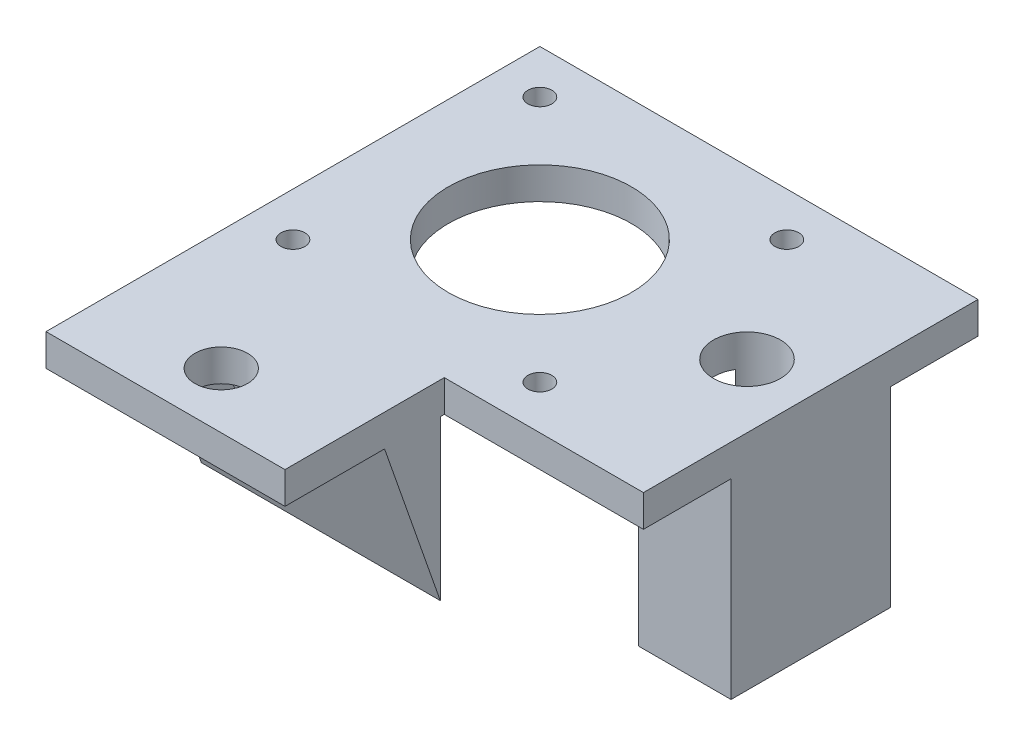
ISO-10303-21;
HEADER;
FILE_DESCRIPTION(('STEP AP214'),'2;1');
FILE_NAME('part.step','',(''),(''),'','','');
FILE_SCHEMA(('AUTOMOTIVE_DESIGN { 1 0 10303 214 1 1 1 1 }'));
ENDSEC;
DATA;
#1=APPLICATION_CONTEXT('core data for automotive mechanical design processes');
#2=APPLICATION_PROTOCOL_DEFINITION('international standard','automotive_design',2000,#1);
#3=PRODUCT_CONTEXT('',#1,'mechanical');
#4=PRODUCT('Part','Part','',(#3));
#5=PRODUCT_RELATED_PRODUCT_CATEGORY('part','',(#4));
#6=PRODUCT_DEFINITION_FORMATION('','',#4);
#7=PRODUCT_DEFINITION_CONTEXT('part definition',#1,'design');
#8=PRODUCT_DEFINITION('design','',#6,#7);
#9=PRODUCT_DEFINITION_SHAPE('','',#8);
#10=(LENGTH_UNIT() NAMED_UNIT(*) SI_UNIT(.MILLI.,.METRE.));
#11=(NAMED_UNIT(*) PLANE_ANGLE_UNIT() SI_UNIT($,.RADIAN.));
#12=(NAMED_UNIT(*) SI_UNIT($,.STERADIAN.) SOLID_ANGLE_UNIT());
#13=UNCERTAINTY_MEASURE_WITH_UNIT(LENGTH_MEASURE(1.E-05),#10,'distance_accuracy_value','');
#14=(GEOMETRIC_REPRESENTATION_CONTEXT(3) GLOBAL_UNCERTAINTY_ASSIGNED_CONTEXT((#13)) GLOBAL_UNIT_ASSIGNED_CONTEXT((#10,
#11,#12)) REPRESENTATION_CONTEXT('',''));
#15=CARTESIAN_POINT('',(0.,0.,0.));
#16=DIRECTION('',(0.,0.,1.));
#17=DIRECTION('',(1.,0.,0.));
#18=AXIS2_PLACEMENT_3D('',#15,#16,#17);
#19=CARTESIAN_POINT('',(51.1896201004171,0.,7.5));
#20=DIRECTION('',(0.,-0.330350424728106,0.943858356366017));
#21=DIRECTION('',(0.,-0.943858356366017,-0.330350424728106));
#22=AXIS2_PLACEMENT_3D('',#19,#20,#21);
#23=PLANE('',#22);
#24=DIRECTION('',(-1.,0.,0.));
#25=VECTOR('',#24,1.);
#26=CARTESIAN_POINT('',(51.1896201004171,0.,7.5));
#27=LINE('',#26,#25);
#28=CARTESIAN_POINT('',(30.,0.,7.5));
#29=VERTEX_POINT('',#28);
#30=CARTESIAN_POINT('',(21.8053287944081,0.,7.5));
#31=VERTEX_POINT('',#30);
#32=EDGE_CURVE('E150',#29,#31,#27,.T.);
#33=ORIENTED_EDGE('',*,*,#32,.T.);
#34=CARTESIAN_POINT('',(15.,15.7142857142857,13.));
#35=DIRECTION('',(0.,-0.330350424728106,0.943858356366017));
#36=DIRECTION('',(0.,0.943858356366017,0.330350424728106));
#37=AXIS2_PLACEMENT_3D('',#34,#35,#36);
#38=ELLIPSE('',#37,26.4870251255214,8.75);
#39=CARTESIAN_POINT('',(8.1946712055919,0.,7.5));
#40=VERTEX_POINT('',#39);
#41=EDGE_CURVE('E11',#31,#40,#38,.F.);
#42=ORIENTED_EDGE('',*,*,#41,.T.);
#43=CARTESIAN_POINT('',(0.,0.,7.5));
#44=VERTEX_POINT('',#43);
#45=EDGE_CURVE('E55',#40,#44,#27,.T.);
#46=ORIENTED_EDGE('',*,*,#45,.T.);
#47=DIRECTION('',(0.,0.943858356366017,0.330350424728106));
#48=VECTOR('',#47,1.);
#49=CARTESIAN_POINT('',(0.,0.,7.5));
#50=LINE('',#49,#48);
#51=CARTESIAN_POINT('',(0.,-20.,0.5));
#52=VERTEX_POINT('',#51);
#53=EDGE_CURVE('E160',#52,#44,#50,.T.);
#54=ORIENTED_EDGE('',*,*,#53,.F.);
#55=DIRECTION('',(-1.,0.,0.));
#56=VECTOR('',#55,1.);
#57=CARTESIAN_POINT('',(51.1896201004171,-20.,0.5));
#58=LINE('',#57,#56);
#59=CARTESIAN_POINT('',(30.,-20.,0.5));
#60=VERTEX_POINT('',#59);
#61=EDGE_CURVE('E157',#60,#52,#58,.T.);
#62=ORIENTED_EDGE('',*,*,#61,.F.);
#63=DIRECTION('',(0.,-0.943858356366017,-0.330350424728106));
#64=VECTOR('',#63,1.);
#65=CARTESIAN_POINT('',(30.,0.,7.5));
#66=LINE('',#65,#64);
#67=EDGE_CURVE('E165',#29,#60,#66,.T.);
#68=ORIENTED_EDGE('',*,*,#67,.F.);
#69=EDGE_LOOP('',(#33,#42,#46,#54,#62,#68));
#70=FACE_BOUND('',#69,.T.);
#71=ADVANCED_FACE('F34',(#70),#23,.T.);
#72=CARTESIAN_POINT('',(0.,0.,0.));
#73=DIRECTION('',(0.,1.,0.));
#74=DIRECTION('',(0.,0.,1.));
#75=AXIS2_PLACEMENT_3D('',#72,#73,#74);
#76=PLANE('',#75);
#77=CARTESIAN_POINT('',(21.,0.,-21.));
#78=DIRECTION('',(0.,1.,0.));
#79=DIRECTION('',(0.,0.,1.));
#80=AXIS2_PLACEMENT_3D('',#77,#78,#79);
#81=CIRCLE('',#80,11.5);
#82=CARTESIAN_POINT('',(21.,0.,-9.5));
#83=VERTEX_POINT('',#82);
#84=EDGE_CURVE('E237',#83,#83,#81,.T.);
#85=ORIENTED_EDGE('',*,*,#84,.T.);
#86=EDGE_LOOP('',(#85));
#87=FACE_BOUND('',#86,.T.);
#88=CARTESIAN_POINT('',(5.5,0.,-36.5));
#89=DIRECTION('',(0.,1.,0.));
#90=DIRECTION('',(0.,0.,1.));
#91=AXIS2_PLACEMENT_3D('',#88,#89,#90);
#92=CIRCLE('',#91,1.5);
#93=CARTESIAN_POINT('',(5.5,0.,-35.));
#94=VERTEX_POINT('',#93);
#95=EDGE_CURVE('E231',#94,#94,#92,.T.);
#96=ORIENTED_EDGE('',*,*,#95,.T.);
#97=EDGE_LOOP('',(#96));
#98=FACE_BOUND('',#97,.T.);
#99=CARTESIAN_POINT('',(36.5,0.,-36.5));
#100=DIRECTION('',(0.,1.,0.));
#101=DIRECTION('',(0.,0.,-1.));
#102=AXIS2_PLACEMENT_3D('',#99,#100,#101);
#103=CIRCLE('',#102,1.5);
#104=CARTESIAN_POINT('',(36.5,0.,-38.));
#105=VERTEX_POINT('',#104);
#106=EDGE_CURVE('E225',#105,#105,#103,.T.);
#107=ORIENTED_EDGE('',*,*,#106,.T.);
#108=EDGE_LOOP('',(#107));
#109=FACE_BOUND('',#108,.T.);
#110=CARTESIAN_POINT('',(5.5,0.,-5.49999999999998));
#111=DIRECTION('',(0.,1.,0.));
#112=DIRECTION('',(0.,0.,-1.));
#113=AXIS2_PLACEMENT_3D('',#110,#111,#112);
#114=CIRCLE('',#113,1.5);
#115=CARTESIAN_POINT('',(5.5,0.,-6.99999999999999));
#116=VERTEX_POINT('',#115);
#117=EDGE_CURVE('E219',#116,#116,#114,.T.);
#118=ORIENTED_EDGE('',*,*,#117,.T.);
#119=EDGE_LOOP('',(#118));
#120=FACE_BOUND('',#119,.T.);
#121=CARTESIAN_POINT('',(36.5,0.,-5.49999999999998));
#122=DIRECTION('',(0.,1.,0.));
#123=DIRECTION('',(0.,0.,1.));
#124=AXIS2_PLACEMENT_3D('',#121,#122,#123);
#125=CIRCLE('',#124,1.5);
#126=CARTESIAN_POINT('',(36.5,0.,-3.99999999999998));
#127=VERTEX_POINT('',#126);
#128=EDGE_CURVE('E213',#127,#127,#125,.T.);
#129=ORIENTED_EDGE('',*,*,#128,.T.);
#130=EDGE_LOOP('',(#129));
#131=FACE_BOUND('',#130,.T.);
#132=DIRECTION('',(0.,0.,-1.));
#133=VECTOR('',#132,1.);
#134=CARTESIAN_POINT('',(30.,0.,20.));
#135=LINE('',#134,#133);
#136=CARTESIAN_POINT('',(30.,0.,0.5));
#137=VERTEX_POINT('',#136);
#138=CARTESIAN_POINT('',(30.,0.,0.));
#139=VERTEX_POINT('',#138);
#140=EDGE_CURVE('E269',#137,#139,#135,.T.);
#141=ORIENTED_EDGE('',*,*,#140,.F.);
#142=DIRECTION('',(-1.,0.,0.));
#143=VECTOR('',#142,1.);
#144=CARTESIAN_POINT('',(51.1896201004171,0.,0.5));
#145=LINE('',#144,#143);
#146=CARTESIAN_POINT('',(0.,0.,0.5));
#147=VERTEX_POINT('',#146);
#148=EDGE_CURVE('E159',#137,#147,#145,.T.);
#149=ORIENTED_EDGE('',*,*,#148,.T.);
#150=DIRECTION('',(0.,0.,1.));
#151=VECTOR('',#150,1.);
#152=CARTESIAN_POINT('',(0.,0.,0.));
#153=LINE('',#152,#151);
#154=CARTESIAN_POINT('',(0.,0.,-42.));
#155=VERTEX_POINT('',#154);
#156=EDGE_CURVE('E256',#155,#147,#153,.T.);
#157=ORIENTED_EDGE('',*,*,#156,.F.);
#158=DIRECTION('',(-1.,0.,0.));
#159=VECTOR('',#158,1.);
#160=CARTESIAN_POINT('',(0.,0.,-42.));
#161=LINE('',#160,#159);
#162=CARTESIAN_POINT('',(55.,0.,-42.));
#163=VERTEX_POINT('',#162);
#164=EDGE_CURVE('E279',#163,#155,#161,.T.);
#165=ORIENTED_EDGE('',*,*,#164,.F.);
#166=DIRECTION('',(0.,0.,-1.));
#167=VECTOR('',#166,1.);
#168=CARTESIAN_POINT('',(55.,0.,0.));
#169=LINE('',#168,#167);
#170=CARTESIAN_POINT('',(55.,0.,-31.));
#171=VERTEX_POINT('',#170);
#172=EDGE_CURVE('E275',#171,#163,#169,.T.);
#173=ORIENTED_EDGE('',*,*,#172,.F.);
#174=DIRECTION('',(-1.,0.,0.));
#175=VECTOR('',#174,1.);
#176=CARTESIAN_POINT('',(0.,0.,-31.));
#177=LINE('',#176,#175);
#178=CARTESIAN_POINT('',(43.4,0.,-31.));
#179=VERTEX_POINT('',#178);
#180=EDGE_CURVE('E190',#171,#179,#177,.T.);
#181=ORIENTED_EDGE('',*,*,#180,.T.);
#182=DIRECTION('',(0.,0.,-1.));
#183=VECTOR('',#182,1.);
#184=CARTESIAN_POINT('',(43.4,0.,0.));
#185=LINE('',#184,#183);
#186=CARTESIAN_POINT('',(43.4,0.,-23.1633307652784));
#187=VERTEX_POINT('',#186);
#188=EDGE_CURVE('E181',#187,#179,#185,.T.);
#189=ORIENTED_EDGE('',*,*,#188,.F.);
#190=CARTESIAN_POINT('',(47.,0.,-21.));
#191=DIRECTION('',(0.,1.,0.));
#192=DIRECTION('',(0.,0.,1.));
#193=AXIS2_PLACEMENT_3D('',#190,#191,#192);
#194=CIRCLE('',#193,4.2);
#195=CARTESIAN_POINT('',(43.4,0.,-18.8366692347216));
#196=VERTEX_POINT('',#195);
#197=EDGE_CURVE('E243',#187,#196,#194,.T.);
#198=ORIENTED_EDGE('',*,*,#197,.T.);
#199=CARTESIAN_POINT('',(43.4,0.,-11.));
#200=VERTEX_POINT('',#199);
#201=EDGE_CURVE('E188',#200,#196,#185,.T.);
#202=ORIENTED_EDGE('',*,*,#201,.F.);
#203=DIRECTION('',(-1.,0.,0.));
#204=VECTOR('',#203,1.);
#205=CARTESIAN_POINT('',(0.,0.,-11.));
#206=LINE('',#205,#204);
#207=CARTESIAN_POINT('',(55.,0.,-11.));
#208=VERTEX_POINT('',#207);
#209=EDGE_CURVE('E193',#208,#200,#206,.T.);
#210=ORIENTED_EDGE('',*,*,#209,.F.);
#211=CARTESIAN_POINT('',(55.,0.,0.));
#212=VERTEX_POINT('',#211);
#213=EDGE_CURVE('E276',#212,#208,#169,.T.);
#214=ORIENTED_EDGE('',*,*,#213,.F.);
#215=DIRECTION('',(1.,0.,0.));
#216=VECTOR('',#215,1.);
#217=CARTESIAN_POINT('',(30.,0.,0.));
#218=LINE('',#217,#216);
#219=EDGE_CURVE('E273',#139,#212,#218,.T.);
#220=ORIENTED_EDGE('',*,*,#219,.F.);
#221=EDGE_LOOP('',(#141,#149,#157,#165,#173,#181,#189,#198,#202,#210,#214,#220));
#222=FACE_BOUND('',#221,.T.);
#223=ADVANCED_FACE('F324',(#87,#98,#109,#120,#131,#222),#76,.F.);
#224=CARTESIAN_POINT('',(30.,0.,20.));
#225=VERTEX_POINT('',#224);
#226=EDGE_CURVE('E270',#225,#29,#135,.T.);
#227=ORIENTED_EDGE('',*,*,#226,.F.);
#228=DIRECTION('',(1.,0.,0.));
#229=VECTOR('',#228,1.);
#230=CARTESIAN_POINT('',(0.,0.,20.));
#231=LINE('',#230,#229);
#232=CARTESIAN_POINT('',(0.,0.,20.));
#233=VERTEX_POINT('',#232);
#234=EDGE_CURVE('E249',#233,#225,#231,.T.);
#235=ORIENTED_EDGE('',*,*,#234,.F.);
#236=EDGE_CURVE('E156',#44,#233,#153,.T.);
#237=ORIENTED_EDGE('',*,*,#236,.F.);
#238=ORIENTED_EDGE('',*,*,#45,.F.);
#239=CARTESIAN_POINT('',(15.,0.,13.));
#240=DIRECTION('',(0.,-1.,0.));
#241=DIRECTION('',(0.,0.,-1.));
#242=AXIS2_PLACEMENT_3D('',#239,#240,#241);
#243=CIRCLE('',#242,8.75);
#244=EDGE_CURVE('E49',#40,#31,#243,.T.);
#245=ORIENTED_EDGE('',*,*,#244,.T.);
#246=ORIENTED_EDGE('',*,*,#32,.F.);
#247=EDGE_LOOP('',(#227,#235,#237,#238,#245,#246));
#248=FACE_BOUND('',#247,.T.);
#249=CARTESIAN_POINT('',(15.,0.,13.));
#250=DIRECTION('',(0.,1.,0.));
#251=DIRECTION('',(0.,0.,1.));
#252=AXIS2_PLACEMENT_3D('',#249,#250,#251);
#253=CIRCLE('',#252,3.3);
#254=CARTESIAN_POINT('',(15.,0.,16.3));
#255=VERTEX_POINT('',#254);
#256=EDGE_CURVE('E209',#255,#255,#253,.T.);
#257=ORIENTED_EDGE('',*,*,#256,.T.);
#258=EDGE_LOOP('',(#257));
#259=FACE_BOUND('',#258,.T.);
#260=ADVANCED_FACE('F153',(#248,#259),#76,.F.);
#261=CARTESIAN_POINT('',(0.,4.,0.));
#262=DIRECTION('',(0.,1.,0.));
#263=DIRECTION('',(0.,0.,1.));
#264=AXIS2_PLACEMENT_3D('',#261,#262,#263);
#265=PLANE('',#264);
#266=CARTESIAN_POINT('',(36.5,4.,-5.49999999999998));
#267=DIRECTION('',(0.,1.,0.));
#268=DIRECTION('',(0.,0.,1.));
#269=AXIS2_PLACEMENT_3D('',#266,#267,#268);
#270=CIRCLE('',#269,1.5);
#271=CARTESIAN_POINT('',(36.5,4.,-3.99999999999998));
#272=VERTEX_POINT('',#271);
#273=EDGE_CURVE('E216',#272,#272,#270,.T.);
#274=ORIENTED_EDGE('',*,*,#273,.F.);
#275=EDGE_LOOP('',(#274));
#276=FACE_BOUND('',#275,.T.);
#277=CARTESIAN_POINT('',(36.5,4.,-36.5));
#278=DIRECTION('',(0.,1.,0.));
#279=DIRECTION('',(0.,0.,-1.));
#280=AXIS2_PLACEMENT_3D('',#277,#278,#279);
#281=CIRCLE('',#280,1.5);
#282=CARTESIAN_POINT('',(36.5,4.,-38.));
#283=VERTEX_POINT('',#282);
#284=EDGE_CURVE('E228',#283,#283,#281,.T.);
#285=ORIENTED_EDGE('',*,*,#284,.F.);
#286=EDGE_LOOP('',(#285));
#287=FACE_BOUND('',#286,.T.);
#288=CARTESIAN_POINT('',(21.,4.,-21.));
#289=DIRECTION('',(0.,1.,0.));
#290=DIRECTION('',(0.,0.,1.));
#291=AXIS2_PLACEMENT_3D('',#288,#289,#290);
#292=CIRCLE('',#291,11.5);
#293=CARTESIAN_POINT('',(21.,4.,-9.5));
#294=VERTEX_POINT('',#293);
#295=EDGE_CURVE('E240',#294,#294,#292,.T.);
#296=ORIENTED_EDGE('',*,*,#295,.F.);
#297=EDGE_LOOP('',(#296));
#298=FACE_BOUND('',#297,.T.);
#299=DIRECTION('',(0.,0.,1.));
#300=VECTOR('',#299,1.);
#301=CARTESIAN_POINT('',(0.,4.,0.));
#302=LINE('',#301,#300);
#303=CARTESIAN_POINT('',(0.,4.,-42.));
#304=VERTEX_POINT('',#303);
#305=CARTESIAN_POINT('',(0.,4.,20.));
#306=VERTEX_POINT('',#305);
#307=EDGE_CURVE('E252',#304,#306,#302,.T.);
#308=ORIENTED_EDGE('',*,*,#307,.T.);
#309=DIRECTION('',(1.,0.,0.));
#310=VECTOR('',#309,1.);
#311=CARTESIAN_POINT('',(0.,4.,20.));
#312=LINE('',#311,#310);
#313=CARTESIAN_POINT('',(30.,4.,20.));
#314=VERTEX_POINT('',#313);
#315=EDGE_CURVE('E255',#306,#314,#312,.T.);
#316=ORIENTED_EDGE('',*,*,#315,.T.);
#317=DIRECTION('',(0.,0.,-1.));
#318=VECTOR('',#317,1.);
#319=CARTESIAN_POINT('',(30.,4.,20.));
#320=LINE('',#319,#318);
#321=CARTESIAN_POINT('',(30.,4.,0.));
#322=VERTEX_POINT('',#321);
#323=EDGE_CURVE('E258',#314,#322,#320,.T.);
#324=ORIENTED_EDGE('',*,*,#323,.T.);
#325=DIRECTION('',(1.,0.,0.));
#326=VECTOR('',#325,1.);
#327=CARTESIAN_POINT('',(30.,4.,0.));
#328=LINE('',#327,#326);
#329=CARTESIAN_POINT('',(55.,4.,0.));
#330=VERTEX_POINT('',#329);
#331=EDGE_CURVE('E260',#322,#330,#328,.T.);
#332=ORIENTED_EDGE('',*,*,#331,.T.);
#333=DIRECTION('',(0.,0.,-1.));
#334=VECTOR('',#333,1.);
#335=CARTESIAN_POINT('',(55.,4.,0.));
#336=LINE('',#335,#334);
#337=CARTESIAN_POINT('',(55.,4.,-42.));
#338=VERTEX_POINT('',#337);
#339=EDGE_CURVE('E262',#330,#338,#336,.T.);
#340=ORIENTED_EDGE('',*,*,#339,.T.);
#341=DIRECTION('',(-1.,0.,0.));
#342=VECTOR('',#341,1.);
#343=CARTESIAN_POINT('',(0.,4.,-42.));
#344=LINE('',#343,#342);
#345=EDGE_CURVE('E264',#338,#304,#344,.T.);
#346=ORIENTED_EDGE('',*,*,#345,.T.);
#347=EDGE_LOOP('',(#308,#316,#324,#332,#340,#346));
#348=FACE_BOUND('',#347,.T.);
#349=CARTESIAN_POINT('',(47.,4.,-21.));
#350=DIRECTION('',(0.,1.,0.));
#351=DIRECTION('',(0.,0.,1.));
#352=AXIS2_PLACEMENT_3D('',#349,#350,#351);
#353=CIRCLE('',#352,4.2);
#354=CARTESIAN_POINT('',(47.,4.,-16.8));
#355=VERTEX_POINT('',#354);
#356=EDGE_CURVE('E246',#355,#355,#353,.T.);
#357=ORIENTED_EDGE('',*,*,#356,.F.);
#358=EDGE_LOOP('',(#357));
#359=FACE_BOUND('',#358,.T.);
#360=CARTESIAN_POINT('',(5.5,4.,-36.5));
#361=DIRECTION('',(0.,1.,0.));
#362=DIRECTION('',(0.,0.,1.));
#363=AXIS2_PLACEMENT_3D('',#360,#361,#362);
#364=CIRCLE('',#363,1.5);
#365=CARTESIAN_POINT('',(5.5,4.,-35.));
#366=VERTEX_POINT('',#365);
#367=EDGE_CURVE('E234',#366,#366,#364,.T.);
#368=ORIENTED_EDGE('',*,*,#367,.F.);
#369=EDGE_LOOP('',(#368));
#370=FACE_BOUND('',#369,.T.);
#371=CARTESIAN_POINT('',(5.5,4.,-5.49999999999998));
#372=DIRECTION('',(0.,1.,0.));
#373=DIRECTION('',(0.,0.,-1.));
#374=AXIS2_PLACEMENT_3D('',#371,#372,#373);
#375=CIRCLE('',#374,1.5);
#376=CARTESIAN_POINT('',(5.5,4.,-6.99999999999999));
#377=VERTEX_POINT('',#376);
#378=EDGE_CURVE('E222',#377,#377,#375,.T.);
#379=ORIENTED_EDGE('',*,*,#378,.F.);
#380=EDGE_LOOP('',(#379));
#381=FACE_BOUND('',#380,.T.);
#382=CARTESIAN_POINT('',(15.,4.,13.));
#383=DIRECTION('',(0.,1.,0.));
#384=DIRECTION('',(0.,0.,1.));
#385=AXIS2_PLACEMENT_3D('',#382,#383,#384);
#386=CIRCLE('',#385,3.3);
#387=CARTESIAN_POINT('',(15.,4.,16.3));
#388=VERTEX_POINT('',#387);
#389=EDGE_CURVE('E210',#388,#388,#386,.T.);
#390=ORIENTED_EDGE('',*,*,#389,.F.);
#391=EDGE_LOOP('',(#390));
#392=FACE_BOUND('',#391,.T.);
#393=ADVANCED_FACE('F310',(#276,#287,#298,#348,#359,#370,#381,#392),#265,.T.);
#394=CARTESIAN_POINT('',(0.,4.,20.));
#395=DIRECTION('',(0.,0.,-1.));
#396=DIRECTION('',(-1.,0.,0.));
#397=AXIS2_PLACEMENT_3D('',#394,#395,#396);
#398=PLANE('',#397);
#399=ORIENTED_EDGE('',*,*,#234,.T.);
#400=DIRECTION('',(0.,-1.,0.));
#401=VECTOR('',#400,1.);
#402=CARTESIAN_POINT('',(30.,4.,20.));
#403=LINE('',#402,#401);
#404=EDGE_CURVE('E294',#314,#225,#403,.T.);
#405=ORIENTED_EDGE('',*,*,#404,.F.);
#406=ORIENTED_EDGE('',*,*,#315,.F.);
#407=DIRECTION('',(0.,-1.,0.));
#408=VECTOR('',#407,1.);
#409=CARTESIAN_POINT('',(0.,4.,20.));
#410=LINE('',#409,#408);
#411=EDGE_CURVE('E42',#306,#233,#410,.T.);
#412=ORIENTED_EDGE('',*,*,#411,.T.);
#413=EDGE_LOOP('',(#399,#405,#406,#412));
#414=FACE_BOUND('',#413,.T.);
#415=ADVANCED_FACE('F36',(#414),#398,.F.);
#416=CARTESIAN_POINT('',(30.,4.,20.));
#417=DIRECTION('',(-1.,0.,0.));
#418=DIRECTION('',(0.,0.,1.));
#419=AXIS2_PLACEMENT_3D('',#416,#417,#418);
#420=PLANE('',#419);
#421=ORIENTED_EDGE('',*,*,#226,.T.);
#422=ORIENTED_EDGE('',*,*,#67,.T.);
#423=DIRECTION('',(0.,1.,0.));
#424=VECTOR('',#423,1.);
#425=CARTESIAN_POINT('',(30.,-20.,0.5));
#426=LINE('',#425,#424);
#427=EDGE_CURVE('E168',#60,#137,#426,.T.);
#428=ORIENTED_EDGE('',*,*,#427,.T.);
#429=ORIENTED_EDGE('',*,*,#140,.T.);
#430=DIRECTION('',(0.,-1.,0.));
#431=VECTOR('',#430,1.);
#432=CARTESIAN_POINT('',(30.,4.,0.));
#433=LINE('',#432,#431);
#434=EDGE_CURVE('E291',#322,#139,#433,.T.);
#435=ORIENTED_EDGE('',*,*,#434,.F.);
#436=ORIENTED_EDGE('',*,*,#323,.F.);
#437=ORIENTED_EDGE('',*,*,#404,.T.);
#438=EDGE_LOOP('',(#421,#422,#428,#429,#435,#436,#437));
#439=FACE_BOUND('',#438,.T.);
#440=ADVANCED_FACE('F304',(#439),#420,.F.);
#441=CARTESIAN_POINT('',(30.,4.,0.));
#442=DIRECTION('',(0.,0.,-1.));
#443=DIRECTION('',(-1.,0.,0.));
#444=AXIS2_PLACEMENT_3D('',#441,#442,#443);
#445=PLANE('',#444);
#446=ORIENTED_EDGE('',*,*,#219,.T.);
#447=DIRECTION('',(0.,-1.,0.));
#448=VECTOR('',#447,1.);
#449=CARTESIAN_POINT('',(55.,4.,0.));
#450=LINE('',#449,#448);
#451=EDGE_CURVE('E288',#330,#212,#450,.T.);
#452=ORIENTED_EDGE('',*,*,#451,.F.);
#453=ORIENTED_EDGE('',*,*,#331,.F.);
#454=ORIENTED_EDGE('',*,*,#434,.T.);
#455=EDGE_LOOP('',(#446,#452,#453,#454));
#456=FACE_BOUND('',#455,.T.);
#457=ADVANCED_FACE('F366',(#456),#445,.F.);
#458=CARTESIAN_POINT('',(55.,4.,0.));
#459=DIRECTION('',(-1.,0.,0.));
#460=DIRECTION('',(0.,0.,1.));
#461=AXIS2_PLACEMENT_3D('',#458,#459,#460);
#462=PLANE('',#461);
#463=ORIENTED_EDGE('',*,*,#213,.T.);
#464=DIRECTION('',(0.,1.,0.));
#465=VECTOR('',#464,1.);
#466=CARTESIAN_POINT('',(55.,-20.,-11.));
#467=LINE('',#466,#465);
#468=CARTESIAN_POINT('',(55.,-24.,-11.));
#469=VERTEX_POINT('',#468);
#470=EDGE_CURVE('E202',#469,#208,#467,.T.);
#471=ORIENTED_EDGE('',*,*,#470,.F.);
#472=DIRECTION('',(0.,0.,1.));
#473=VECTOR('',#472,1.);
#474=CARTESIAN_POINT('',(55.,-24.,-31.));
#475=LINE('',#474,#473);
#476=CARTESIAN_POINT('',(55.,-24.,-31.));
#477=VERTEX_POINT('',#476);
#478=EDGE_CURVE('E169',#477,#469,#475,.T.);
#479=ORIENTED_EDGE('',*,*,#478,.F.);
#480=DIRECTION('',(0.,1.,0.));
#481=VECTOR('',#480,1.);
#482=CARTESIAN_POINT('',(55.,-20.,-31.));
#483=LINE('',#482,#481);
#484=EDGE_CURVE('E204',#477,#171,#483,.T.);
#485=ORIENTED_EDGE('',*,*,#484,.T.);
#486=ORIENTED_EDGE('',*,*,#172,.T.);
#487=DIRECTION('',(0.,-1.,0.));
#488=VECTOR('',#487,1.);
#489=CARTESIAN_POINT('',(55.,4.,-42.));
#490=LINE('',#489,#488);
#491=EDGE_CURVE('E285',#338,#163,#490,.T.);
#492=ORIENTED_EDGE('',*,*,#491,.F.);
#493=ORIENTED_EDGE('',*,*,#339,.F.);
#494=ORIENTED_EDGE('',*,*,#451,.T.);
#495=EDGE_LOOP('',(#463,#471,#479,#485,#486,#492,#493,#494));
#496=FACE_BOUND('',#495,.T.);
#497=ADVANCED_FACE('F363',(#496),#462,.F.);
#498=CARTESIAN_POINT('',(0.,4.,-42.));
#499=DIRECTION('',(0.,0.,1.));
#500=DIRECTION('',(1.,0.,0.));
#501=AXIS2_PLACEMENT_3D('',#498,#499,#500);
#502=PLANE('',#501);
#503=ORIENTED_EDGE('',*,*,#164,.T.);
#504=DIRECTION('',(0.,-1.,0.));
#505=VECTOR('',#504,1.);
#506=CARTESIAN_POINT('',(0.,4.,-42.));
#507=LINE('',#506,#505);
#508=EDGE_CURVE('E267',#304,#155,#507,.T.);
#509=ORIENTED_EDGE('',*,*,#508,.F.);
#510=ORIENTED_EDGE('',*,*,#345,.F.);
#511=ORIENTED_EDGE('',*,*,#491,.T.);
#512=EDGE_LOOP('',(#503,#509,#510,#511));
#513=FACE_BOUND('',#512,.T.);
#514=ADVANCED_FACE('F318',(#513),#502,.F.);
#515=CARTESIAN_POINT('',(0.,4.,0.));
#516=DIRECTION('',(1.,0.,0.));
#517=DIRECTION('',(0.,0.,-1.));
#518=AXIS2_PLACEMENT_3D('',#515,#516,#517);
#519=PLANE('',#518);
#520=ORIENTED_EDGE('',*,*,#156,.T.);
#521=DIRECTION('',(0.,-1.,0.));
#522=VECTOR('',#521,1.);
#523=CARTESIAN_POINT('',(0.,-20.,0.5));
#524=LINE('',#523,#522);
#525=EDGE_CURVE('E148',#147,#52,#524,.T.);
#526=ORIENTED_EDGE('',*,*,#525,.T.);
#527=ORIENTED_EDGE('',*,*,#53,.T.);
#528=ORIENTED_EDGE('',*,*,#236,.T.);
#529=ORIENTED_EDGE('',*,*,#411,.F.);
#530=ORIENTED_EDGE('',*,*,#307,.F.);
#531=ORIENTED_EDGE('',*,*,#508,.T.);
#532=EDGE_LOOP('',(#520,#526,#527,#528,#529,#530,#531));
#533=FACE_BOUND('',#532,.T.);
#534=ADVANCED_FACE('F301',(#533),#519,.F.);
#535=CARTESIAN_POINT('',(47.,4.,-21.));
#536=DIRECTION('',(0.,-1.,0.));
#537=DIRECTION('',(0.,0.,-1.));
#538=AXIS2_PLACEMENT_3D('',#535,#536,#537);
#539=CYLINDRICAL_SURFACE('',#538,4.2);
#540=ORIENTED_EDGE('',*,*,#356,.T.);
#541=EDGE_LOOP('',(#540));
#542=FACE_BOUND('',#541,.T.);
#543=ORIENTED_EDGE('',*,*,#197,.F.);
#544=DIRECTION('',(0.,1.,0.));
#545=VECTOR('',#544,1.);
#546=CARTESIAN_POINT('',(43.4,-20.,-23.1633307652784));
#547=LINE('',#546,#545);
#548=CARTESIAN_POINT('',(43.4,-20.,-23.1633307652784));
#549=VERTEX_POINT('',#548);
#550=EDGE_CURVE('E187',#549,#187,#547,.T.);
#551=ORIENTED_EDGE('',*,*,#550,.F.);
#552=CARTESIAN_POINT('',(47.,-20.,-21.));
#553=DIRECTION('',(0.,-1.,0.));
#554=DIRECTION('',(0.,0.,-1.));
#555=AXIS2_PLACEMENT_3D('',#552,#553,#554);
#556=CIRCLE('',#555,4.2);
#557=CARTESIAN_POINT('',(43.4,-20.,-18.8366692347216));
#558=VERTEX_POINT('',#557);
#559=EDGE_CURVE('E184',#558,#549,#556,.F.);
#560=ORIENTED_EDGE('',*,*,#559,.F.);
#561=DIRECTION('',(0.,1.,0.));
#562=VECTOR('',#561,1.);
#563=CARTESIAN_POINT('',(43.4,-20.,-18.8366692347216));
#564=LINE('',#563,#562);
#565=EDGE_CURVE('E196',#558,#196,#564,.T.);
#566=ORIENTED_EDGE('',*,*,#565,.T.);
#567=EDGE_LOOP('',(#543,#551,#560,#566));
#568=FACE_BOUND('',#567,.T.);
#569=ADVANCED_FACE('F360',(#542,#568),#539,.F.);
#570=CARTESIAN_POINT('',(21.,4.,-21.));
#571=DIRECTION('',(0.,-1.,0.));
#572=DIRECTION('',(0.,0.,-1.));
#573=AXIS2_PLACEMENT_3D('',#570,#571,#572);
#574=CYLINDRICAL_SURFACE('',#573,11.5);
#575=ORIENTED_EDGE('',*,*,#295,.T.);
#576=EDGE_LOOP('',(#575));
#577=FACE_BOUND('',#576,.T.);
#578=ORIENTED_EDGE('',*,*,#84,.F.);
#579=EDGE_LOOP('',(#578));
#580=FACE_BOUND('',#579,.T.);
#581=ADVANCED_FACE('F386',(#577,#580),#574,.F.);
#582=CARTESIAN_POINT('',(5.5,4.,-36.5));
#583=DIRECTION('',(0.,-1.,0.));
#584=DIRECTION('',(0.,0.,-1.));
#585=AXIS2_PLACEMENT_3D('',#582,#583,#584);
#586=CYLINDRICAL_SURFACE('',#585,1.5);
#587=ORIENTED_EDGE('',*,*,#367,.T.);
#588=EDGE_LOOP('',(#587));
#589=FACE_BOUND('',#588,.T.);
#590=ORIENTED_EDGE('',*,*,#95,.F.);
#591=EDGE_LOOP('',(#590));
#592=FACE_BOUND('',#591,.T.);
#593=ADVANCED_FACE('F389',(#589,#592),#586,.F.);
#594=CARTESIAN_POINT('',(36.5,4.,-36.5));
#595=DIRECTION('',(0.,-1.,0.));
#596=DIRECTION('',(0.,0.,-1.));
#597=AXIS2_PLACEMENT_3D('',#594,#595,#596);
#598=CYLINDRICAL_SURFACE('',#597,1.5);
#599=ORIENTED_EDGE('',*,*,#284,.T.);
#600=EDGE_LOOP('',(#599));
#601=FACE_BOUND('',#600,.T.);
#602=ORIENTED_EDGE('',*,*,#106,.F.);
#603=EDGE_LOOP('',(#602));
#604=FACE_BOUND('',#603,.T.);
#605=ADVANCED_FACE('F396',(#601,#604),#598,.F.);
#606=CARTESIAN_POINT('',(5.5,4.,-5.49999999999998));
#607=DIRECTION('',(0.,-1.,0.));
#608=DIRECTION('',(0.,0.,-1.));
#609=AXIS2_PLACEMENT_3D('',#606,#607,#608);
#610=CYLINDRICAL_SURFACE('',#609,1.5);
#611=ORIENTED_EDGE('',*,*,#378,.T.);
#612=EDGE_LOOP('',(#611));
#613=FACE_BOUND('',#612,.T.);
#614=ORIENTED_EDGE('',*,*,#117,.F.);
#615=EDGE_LOOP('',(#614));
#616=FACE_BOUND('',#615,.T.);
#617=ADVANCED_FACE('F403',(#613,#616),#610,.F.);
#618=CARTESIAN_POINT('',(36.5,4.,-5.49999999999998));
#619=DIRECTION('',(0.,-1.,0.));
#620=DIRECTION('',(0.,0.,-1.));
#621=AXIS2_PLACEMENT_3D('',#618,#619,#620);
#622=CYLINDRICAL_SURFACE('',#621,1.5);
#623=ORIENTED_EDGE('',*,*,#273,.T.);
#624=EDGE_LOOP('',(#623));
#625=FACE_BOUND('',#624,.T.);
#626=ORIENTED_EDGE('',*,*,#128,.F.);
#627=EDGE_LOOP('',(#626));
#628=FACE_BOUND('',#627,.T.);
#629=ADVANCED_FACE('F407',(#625,#628),#622,.F.);
#630=CARTESIAN_POINT('',(15.,4.,13.));
#631=DIRECTION('',(0.,-1.,0.));
#632=DIRECTION('',(0.,0.,-1.));
#633=AXIS2_PLACEMENT_3D('',#630,#631,#632);
#634=CYLINDRICAL_SURFACE('',#633,3.3);
#635=ORIENTED_EDGE('',*,*,#389,.T.);
#636=EDGE_LOOP('',(#635));
#637=FACE_BOUND('',#636,.T.);
#638=ORIENTED_EDGE('',*,*,#256,.F.);
#639=EDGE_LOOP('',(#638));
#640=FACE_BOUND('',#639,.T.);
#641=ADVANCED_FACE('F411',(#637,#640),#634,.F.);
#642=CARTESIAN_POINT('',(43.4,-20.,0.));
#643=DIRECTION('',(1.,0.,0.));
#644=DIRECTION('',(0.,0.,-1.));
#645=AXIS2_PLACEMENT_3D('',#642,#643,#644);
#646=PLANE('',#645);
#647=ORIENTED_EDGE('',*,*,#188,.T.);
#648=DIRECTION('',(0.,1.,0.));
#649=VECTOR('',#648,1.);
#650=CARTESIAN_POINT('',(43.4,-20.,-31.));
#651=LINE('',#650,#649);
#652=CARTESIAN_POINT('',(43.4,-24.,-31.));
#653=VERTEX_POINT('',#652);
#654=EDGE_CURVE('E206',#653,#179,#651,.T.);
#655=ORIENTED_EDGE('',*,*,#654,.F.);
#656=DIRECTION('',(0.,0.,-1.));
#657=VECTOR('',#656,1.);
#658=CARTESIAN_POINT('',(43.4,-24.,-31.));
#659=LINE('',#658,#657);
#660=CARTESIAN_POINT('',(43.4,-24.,-11.));
#661=VERTEX_POINT('',#660);
#662=EDGE_CURVE('E175',#661,#653,#659,.T.);
#663=ORIENTED_EDGE('',*,*,#662,.F.);
#664=DIRECTION('',(0.,1.,0.));
#665=VECTOR('',#664,1.);
#666=CARTESIAN_POINT('',(43.4,-20.,-11.));
#667=LINE('',#666,#665);
#668=EDGE_CURVE('E199',#661,#200,#667,.T.);
#669=ORIENTED_EDGE('',*,*,#668,.T.);
#670=ORIENTED_EDGE('',*,*,#201,.T.);
#671=ORIENTED_EDGE('',*,*,#565,.F.);
#672=DIRECTION('',(0.,0.,-1.));
#673=VECTOR('',#672,1.);
#674=CARTESIAN_POINT('',(43.4,-20.,-31.));
#675=LINE('',#674,#673);
#676=EDGE_CURVE('E167',#558,#549,#675,.T.);
#677=ORIENTED_EDGE('',*,*,#676,.T.);
#678=ORIENTED_EDGE('',*,*,#550,.T.);
#679=EDGE_LOOP('',(#647,#655,#663,#669,#670,#671,#677,#678));
#680=FACE_BOUND('',#679,.T.);
#681=ADVANCED_FACE('F415',(#680),#646,.F.);
#682=CARTESIAN_POINT('',(0.,-20.,-31.));
#683=DIRECTION('',(0.,0.,-1.));
#684=DIRECTION('',(-1.,0.,0.));
#685=AXIS2_PLACEMENT_3D('',#682,#683,#684);
#686=PLANE('',#685);
#687=ORIENTED_EDGE('',*,*,#180,.F.);
#688=ORIENTED_EDGE('',*,*,#484,.F.);
#689=DIRECTION('',(1.,0.,0.));
#690=VECTOR('',#689,1.);
#691=CARTESIAN_POINT('',(55.,-24.,-31.));
#692=LINE('',#691,#690);
#693=EDGE_CURVE('E178',#653,#477,#692,.T.);
#694=ORIENTED_EDGE('',*,*,#693,.F.);
#695=ORIENTED_EDGE('',*,*,#654,.T.);
#696=EDGE_LOOP('',(#687,#688,#694,#695));
#697=FACE_BOUND('',#696,.T.);
#698=ADVANCED_FACE('F417',(#697),#686,.T.);
#699=CARTESIAN_POINT('',(0.,-20.,-11.));
#700=DIRECTION('',(0.,0.,-1.));
#701=DIRECTION('',(-1.,0.,0.));
#702=AXIS2_PLACEMENT_3D('',#699,#700,#701);
#703=PLANE('',#702);
#704=ORIENTED_EDGE('',*,*,#209,.T.);
#705=ORIENTED_EDGE('',*,*,#668,.F.);
#706=DIRECTION('',(-1.,0.,0.));
#707=VECTOR('',#706,1.);
#708=CARTESIAN_POINT('',(55.,-24.,-11.));
#709=LINE('',#708,#707);
#710=EDGE_CURVE('E172',#469,#661,#709,.T.);
#711=ORIENTED_EDGE('',*,*,#710,.F.);
#712=ORIENTED_EDGE('',*,*,#470,.T.);
#713=EDGE_LOOP('',(#704,#705,#711,#712));
#714=FACE_BOUND('',#713,.T.);
#715=ADVANCED_FACE('F420',(#714),#703,.F.);
#716=CARTESIAN_POINT('',(0.,-20.,0.));
#717=DIRECTION('',(0.,-1.,0.));
#718=DIRECTION('',(0.,0.,-1.));
#719=AXIS2_PLACEMENT_3D('',#716,#717,#718);
#720=PLANE('',#719);
#721=ORIENTED_EDGE('',*,*,#676,.F.);
#722=ORIENTED_EDGE('',*,*,#559,.T.);
#723=EDGE_LOOP('',(#721,#722));
#724=FACE_BOUND('',#723,.T.);
#725=ADVANCED_FACE('F341',(#724),#720,.F.);
#726=CARTESIAN_POINT('',(0.,-24.,0.));
#727=DIRECTION('',(0.,-1.,0.));
#728=DIRECTION('',(0.,0.,-1.));
#729=AXIS2_PLACEMENT_3D('',#726,#727,#728);
#730=PLANE('',#729);
#731=ORIENTED_EDGE('',*,*,#478,.T.);
#732=ORIENTED_EDGE('',*,*,#710,.T.);
#733=ORIENTED_EDGE('',*,*,#662,.T.);
#734=ORIENTED_EDGE('',*,*,#693,.T.);
#735=EDGE_LOOP('',(#731,#732,#733,#734));
#736=FACE_BOUND('',#735,.T.);
#737=ADVANCED_FACE('F334',(#736),#730,.T.);
#738=CARTESIAN_POINT('',(51.1896201004171,-20.,0.5));
#739=DIRECTION('',(0.,0.,-1.));
#740=DIRECTION('',(-1.,0.,0.));
#741=AXIS2_PLACEMENT_3D('',#738,#739,#740);
#742=PLANE('',#741);
#743=ORIENTED_EDGE('',*,*,#427,.F.);
#744=ORIENTED_EDGE('',*,*,#61,.T.);
#745=ORIENTED_EDGE('',*,*,#525,.F.);
#746=ORIENTED_EDGE('',*,*,#148,.F.);
#747=EDGE_LOOP('',(#743,#744,#745,#746));
#748=FACE_BOUND('',#747,.T.);
#749=ADVANCED_FACE('F331',(#748),#742,.T.);
#750=CARTESIAN_POINT('',(15.,-24.,13.));
#751=DIRECTION('',(0.,1.,0.));
#752=DIRECTION('',(0.,0.,1.));
#753=AXIS2_PLACEMENT_3D('',#750,#751,#752);
#754=CYLINDRICAL_SURFACE('',#753,8.75);
#755=ORIENTED_EDGE('',*,*,#244,.F.);
#756=ORIENTED_EDGE('',*,*,#41,.F.);
#757=EDGE_LOOP('',(#755,#756));
#758=FACE_BOUND('',#757,.T.);
#759=ADVANCED_FACE('F146',(#758),#754,.F.);
#760=CLOSED_SHELL('',(#71,#223,#260,#393,#415,#440,#457,#497,#514,#534,#569,#581,#593,#605,#617,
#629,#641,#681,#698,#715,#725,#737,#749,#759));
#761=MANIFOLD_SOLID_BREP('B2',#760);
#762=ADVANCED_BREP_SHAPE_REPRESENTATION('',(#18,#761),#14);
#763=SHAPE_DEFINITION_REPRESENTATION(#9,#762);
ENDSEC;
END-ISO-10303-21;
